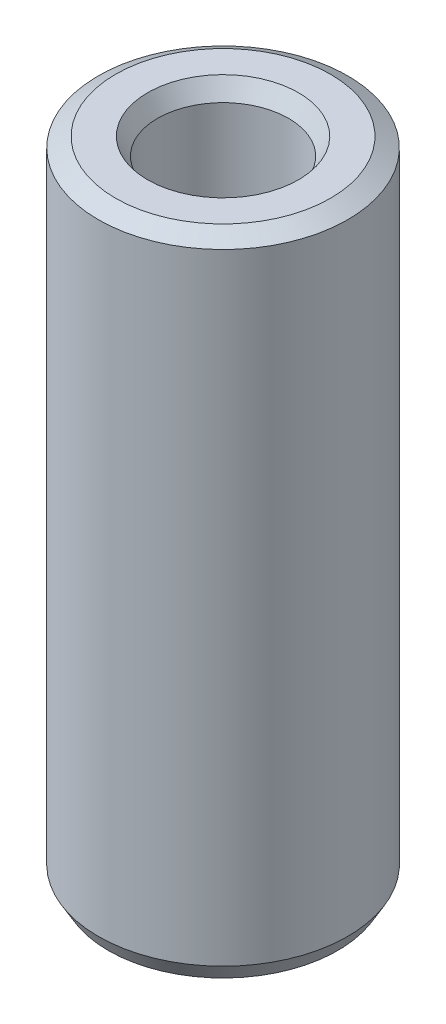
ISO-10303-21;
HEADER;
FILE_DESCRIPTION(('STEP AP214'),'2;1');
FILE_NAME('part.step','',(''),(''),'','','');
FILE_SCHEMA(('AUTOMOTIVE_DESIGN { 1 0 10303 214 1 1 1 1 }'));
ENDSEC;
DATA;
#1=APPLICATION_CONTEXT('core data for automotive mechanical design processes');
#2=APPLICATION_PROTOCOL_DEFINITION('international standard','automotive_design',2000,#1);
#3=PRODUCT_CONTEXT('',#1,'mechanical');
#4=PRODUCT('Part','Part','',(#3));
#5=PRODUCT_RELATED_PRODUCT_CATEGORY('part','',(#4));
#6=PRODUCT_DEFINITION_FORMATION('','',#4);
#7=PRODUCT_DEFINITION_CONTEXT('part definition',#1,'design');
#8=PRODUCT_DEFINITION('design','',#6,#7);
#9=PRODUCT_DEFINITION_SHAPE('','',#8);
#10=(LENGTH_UNIT() NAMED_UNIT(*) SI_UNIT(.MILLI.,.METRE.));
#11=(NAMED_UNIT(*) PLANE_ANGLE_UNIT() SI_UNIT($,.RADIAN.));
#12=(NAMED_UNIT(*) SI_UNIT($,.STERADIAN.) SOLID_ANGLE_UNIT());
#13=UNCERTAINTY_MEASURE_WITH_UNIT(LENGTH_MEASURE(1.E-05),#10,'distance_accuracy_value','');
#14=(GEOMETRIC_REPRESENTATION_CONTEXT(3) GLOBAL_UNCERTAINTY_ASSIGNED_CONTEXT((#13)) GLOBAL_UNIT_ASSIGNED_CONTEXT((#10,
#11,#12)) REPRESENTATION_CONTEXT('',''));
#15=CARTESIAN_POINT('',(0.,0.,0.));
#16=DIRECTION('',(0.,0.,1.));
#17=DIRECTION('',(1.,0.,0.));
#18=AXIS2_PLACEMENT_3D('',#15,#16,#17);
#19=CARTESIAN_POINT('',(0.,142.891635177222,0.));
#20=DIRECTION('',(0.,-1.,0.));
#21=DIRECTION('',(0.,0.,-1.));
#22=AXIS2_PLACEMENT_3D('',#19,#20,#21);
#23=CYLINDRICAL_SURFACE('',#22,27.5);
#24=CARTESIAN_POINT('',(0.,3.8004818086218,0.));
#25=DIRECTION('',(0.,1.,0.));
#26=DIRECTION('',(0.,0.,1.));
#27=AXIS2_PLACEMENT_3D('',#24,#25,#26);
#28=CIRCLE('',#27,27.5);
#29=CARTESIAN_POINT('',(0.,3.8004818086218,27.5));
#30=VERTEX_POINT('',#29);
#31=EDGE_CURVE('E10',#30,#30,#28,.T.);
#32=ORIENTED_EDGE('',*,*,#31,.T.);
#33=EDGE_LOOP('',(#32));
#34=FACE_BOUND('',#33,.T.);
#35=CARTESIAN_POINT('',(0.,140.697425981964,0.));
#36=DIRECTION('',(0.,1.,0.));
#37=DIRECTION('',(0.,0.,1.));
#38=AXIS2_PLACEMENT_3D('',#35,#36,#37);
#39=CIRCLE('',#38,27.5);
#40=CARTESIAN_POINT('',(0.,140.697425981964,27.5));
#41=VERTEX_POINT('',#40);
#42=EDGE_CURVE('E50',#41,#41,#39,.F.);
#43=ORIENTED_EDGE('',*,*,#42,.T.);
#44=EDGE_LOOP('',(#43));
#45=FACE_BOUND('',#44,.T.);
#46=ADVANCED_FACE('F39',(#34,#45),#23,.T.);
#47=CARTESIAN_POINT('',(0.,142.891635177222,0.));
#48=DIRECTION('',(0.,1.,0.));
#49=DIRECTION('',(0.,0.,1.));
#50=AXIS2_PLACEMENT_3D('',#47,#48,#49);
#51=PLANE('',#50);
#52=CARTESIAN_POINT('',(0.,142.891635177222,0.));
#53=DIRECTION('',(0.,1.,0.));
#54=DIRECTION('',(0.,0.,1.));
#55=AXIS2_PLACEMENT_3D('',#52,#53,#54);
#56=CIRCLE('',#55,16.6474647699479);
#57=CARTESIAN_POINT('',(0.,142.891635177222,16.6474647699479));
#58=VERTEX_POINT('',#57);
#59=EDGE_CURVE('E58',#58,#58,#56,.F.);
#60=ORIENTED_EDGE('',*,*,#59,.T.);
#61=EDGE_LOOP('',(#60));
#62=FACE_BOUND('',#61,.T.);
#63=CARTESIAN_POINT('',(0.,142.891635177222,0.));
#64=DIRECTION('',(0.,1.,0.));
#65=DIRECTION('',(0.,0.,1.));
#66=AXIS2_PLACEMENT_3D('',#63,#64,#65);
#67=CIRCLE('',#66,23.6995181913781);
#68=CARTESIAN_POINT('',(0.,142.891635177222,23.6995181913781));
#69=VERTEX_POINT('',#68);
#70=EDGE_CURVE('E61',#69,#69,#67,.T.);
#71=ORIENTED_EDGE('',*,*,#70,.T.);
#72=EDGE_LOOP('',(#71));
#73=FACE_BOUND('',#72,.T.);
#74=ADVANCED_FACE('F88',(#62,#73),#51,.T.);
#75=CARTESIAN_POINT('',(0.,0.,0.));
#76=DIRECTION('',(0.,1.,0.));
#77=DIRECTION('',(0.,0.,1.));
#78=AXIS2_PLACEMENT_3D('',#75,#76,#77);
#79=PLANE('',#78);
#80=CARTESIAN_POINT('',(0.,0.,0.));
#81=DIRECTION('',(0.,1.,0.));
#82=DIRECTION('',(0.,0.,1.));
#83=AXIS2_PLACEMENT_3D('',#80,#81,#82);
#84=CIRCLE('',#83,18.2537373833116);
#85=CARTESIAN_POINT('',(0.,0.,-18.2537373833116));
#86=VERTEX_POINT('',#85);
#87=EDGE_CURVE('E51',#86,#86,#84,.T.);
#88=ORIENTED_EDGE('',*,*,#87,.T.);
#89=EDGE_LOOP('',(#88));
#90=FACE_BOUND('',#89,.T.);
#91=CARTESIAN_POINT('',(0.,0.,0.));
#92=DIRECTION('',(0.,1.,0.));
#93=DIRECTION('',(0.,0.,1.));
#94=AXIS2_PLACEMENT_3D('',#91,#92,#93);
#95=CIRCLE('',#94,25.3057908047419);
#96=CARTESIAN_POINT('',(0.,0.,25.3057908047419));
#97=VERTEX_POINT('',#96);
#98=EDGE_CURVE('E54',#97,#97,#95,.F.);
#99=ORIENTED_EDGE('',*,*,#98,.T.);
#100=EDGE_LOOP('',(#99));
#101=FACE_BOUND('',#100,.T.);
#102=ADVANCED_FACE('F83',(#90,#101),#79,.F.);
#103=CARTESIAN_POINT('',(0.,142.891635177222,0.));
#104=DIRECTION('',(0.,-1.,0.));
#105=DIRECTION('',(0.,0.,-1.));
#106=AXIS2_PLACEMENT_3D('',#103,#104,#105);
#107=CYLINDRICAL_SURFACE('',#106,14.4532555746897);
#108=CARTESIAN_POINT('',(0.,139.0911533686,0.));
#109=DIRECTION('',(0.,1.,0.));
#110=DIRECTION('',(0.,0.,1.));
#111=AXIS2_PLACEMENT_3D('',#108,#109,#110);
#112=CIRCLE('',#111,14.4532555746897);
#113=CARTESIAN_POINT('',(0.,139.0911533686,14.4532555746897));
#114=VERTEX_POINT('',#113);
#115=EDGE_CURVE('E67',#114,#114,#112,.T.);
#116=ORIENTED_EDGE('',*,*,#115,.T.);
#117=EDGE_LOOP('',(#116));
#118=FACE_BOUND('',#117,.T.);
#119=CARTESIAN_POINT('',(0.,2.19420919525812,0.));
#120=DIRECTION('',(0.,1.,0.));
#121=DIRECTION('',(0.,0.,1.));
#122=AXIS2_PLACEMENT_3D('',#119,#120,#121);
#123=CIRCLE('',#122,14.4532555746897);
#124=CARTESIAN_POINT('',(0.,2.19420919525812,-14.4532555746897));
#125=VERTEX_POINT('',#124);
#126=EDGE_CURVE('E69',#125,#125,#123,.F.);
#127=ORIENTED_EDGE('',*,*,#126,.T.);
#128=EDGE_LOOP('',(#127));
#129=FACE_BOUND('',#128,.T.);
#130=ADVANCED_FACE('F71',(#118,#129),#107,.F.);
#131=CARTESIAN_POINT('',(0.,139.0911533686,0.));
#132=DIRECTION('',(0.,1.,0.));
#133=DIRECTION('',(0.,0.,1.));
#134=AXIS2_PLACEMENT_3D('',#131,#132,#133);
#135=CONICAL_SURFACE('',#134,14.4532555746897,0.523598775598301);
#136=ORIENTED_EDGE('',*,*,#59,.F.);
#137=EDGE_LOOP('',(#136));
#138=FACE_BOUND('',#137,.T.);
#139=ORIENTED_EDGE('',*,*,#115,.F.);
#140=EDGE_LOOP('',(#139));
#141=FACE_BOUND('',#140,.T.);
#142=ADVANCED_FACE('F77',(#138,#141),#135,.F.);
#143=CARTESIAN_POINT('',(0.,0.,0.));
#144=DIRECTION('',(0.,-1.,0.));
#145=DIRECTION('',(0.,0.,-1.));
#146=AXIS2_PLACEMENT_3D('',#143,#144,#145);
#147=CONICAL_SURFACE('',#146,18.2537373833116,1.04719755119659);
#148=CARTESIAN_POINT('',(0.,2.19420919525812,-14.4532555746897));
#149=CARTESIAN_POINT('',(0.,2.17135284947418,-14.4928439268629));
#150=CARTESIAN_POINT('',(0.,2.14849650369024,-14.532432279036));
#151=CARTESIAN_POINT('',(0.,2.10278381212236,-14.6116089833823));
#152=CARTESIAN_POINT('',(0.,2.07992746633842,-14.6511973355555));
#153=CARTESIAN_POINT('',(0.,2.03421477477055,-14.7303740399017));
#154=CARTESIAN_POINT('',(0.,2.01135842898661,-14.7699623920749));
#155=CARTESIAN_POINT('',(0.,1.96564573741873,-14.8491390964212));
#156=CARTESIAN_POINT('',(0.,1.94278939163479,-14.8887274485943));
#157=CARTESIAN_POINT('',(0.,1.89707670006691,-14.9679041529406));
#158=CARTESIAN_POINT('',(0.,1.87422035428298,-15.0074925051138));
#159=CARTESIAN_POINT('',(0.,1.8285076627151,-15.08666920946));
#160=CARTESIAN_POINT('',(0.,1.80565131693116,-15.1262575616332));
#161=CARTESIAN_POINT('',(0.,1.75993862536328,-15.2054342659795));
#162=CARTESIAN_POINT('',(0.,1.73708227957934,-15.2450226181526));
#163=CARTESIAN_POINT('',(0.,1.69136958801147,-15.3241993224989));
#164=CARTESIAN_POINT('',(0.,1.66851324222753,-15.3637876746721));
#165=CARTESIAN_POINT('',(0.,1.62280055065965,-15.4429643790183));
#166=CARTESIAN_POINT('',(0.,1.59994420487571,-15.4825527311915));
#167=CARTESIAN_POINT('',(0.,1.55423151330783,-15.5617294355378));
#168=CARTESIAN_POINT('',(0.,1.53137516752389,-15.6013177877109));
#169=CARTESIAN_POINT('',(0.,1.48566247595602,-15.6804944920572));
#170=CARTESIAN_POINT('',(0.,1.46280613017208,-15.7200828442303));
#171=CARTESIAN_POINT('',(0.,1.4170934386042,-15.7992595485766));
#172=CARTESIAN_POINT('',(0.,1.39423709282026,-15.8388479007498));
#173=CARTESIAN_POINT('',(0.,1.34852440125238,-15.9180246050961));
#174=CARTESIAN_POINT('',(0.,1.32566805546845,-15.9576129572692));
#175=CARTESIAN_POINT('',(0.,1.27995536390057,-16.0367896616155));
#176=CARTESIAN_POINT('',(0.,1.25709901811663,-16.0763780137886));
#177=CARTESIAN_POINT('',(0.,1.21138632654875,-16.1555547181349));
#178=CARTESIAN_POINT('',(0.,1.18852998076481,-16.1951430703081));
#179=CARTESIAN_POINT('',(0.,1.14281728919694,-16.2743197746544));
#180=CARTESIAN_POINT('',(0.,1.119960943413,-16.3139081268275));
#181=CARTESIAN_POINT('',(0.,1.07424825184512,-16.3930848311738));
#182=CARTESIAN_POINT('',(0.,1.05139190606118,-16.4326731833469));
#183=CARTESIAN_POINT('',(0.,1.0056792144933,-16.5118498876932));
#184=CARTESIAN_POINT('',(0.,0.982822868709365,-16.5514382398664));
#185=CARTESIAN_POINT('',(0.,0.937110177141488,-16.6306149442127));
#186=CARTESIAN_POINT('',(0.,0.914253831357549,-16.6702032963858));
#187=CARTESIAN_POINT('',(0.,0.868541139789671,-16.7493800007321));
#188=CARTESIAN_POINT('',(0.,0.845684794005733,-16.7889683529052));
#189=CARTESIAN_POINT('',(0.,0.799972102437856,-16.8681450572515));
#190=CARTESIAN_POINT('',(0.,0.777115756653917,-16.9077334094247));
#191=CARTESIAN_POINT('',(0.,0.731403065086039,-16.986910113771));
#192=CARTESIAN_POINT('',(0.,0.708546719302101,-17.0264984659441));
#193=CARTESIAN_POINT('',(0.,0.662834027734223,-17.1056751702904));
#194=CARTESIAN_POINT('',(0.,0.639977681950284,-17.1452635224635));
#195=CARTESIAN_POINT('',(0.,0.594264990382407,-17.2244402268098));
#196=CARTESIAN_POINT('',(0.,0.571408644598468,-17.264028578983));
#197=CARTESIAN_POINT('',(0.,0.525695953030591,-17.3432052833293));
#198=CARTESIAN_POINT('',(0.,0.502839607246652,-17.3827936355024));
#199=CARTESIAN_POINT('',(0.,0.457126915678774,-17.4619703398487));
#200=CARTESIAN_POINT('',(0.,0.434270569894835,-17.5015586920218));
#201=CARTESIAN_POINT('',(0.,0.388557878326958,-17.5807353963681));
#202=CARTESIAN_POINT('',(0.,0.36570153254302,-17.6203237485413));
#203=CARTESIAN_POINT('',(0.,0.319988840975142,-17.6995004528876));
#204=CARTESIAN_POINT('',(0.,0.297132495191203,-17.7390888050607));
#205=CARTESIAN_POINT('',(0.,0.251419803623326,-17.818265509407));
#206=CARTESIAN_POINT('',(0.,0.228563457839387,-17.8578538615801));
#207=CARTESIAN_POINT('',(0.,0.18285076627151,-17.9370305659264));
#208=CARTESIAN_POINT('',(0.,0.159994420487571,-17.9766189180996));
#209=CARTESIAN_POINT('',(0.,0.114281728919693,-18.0557956224458));
#210=CARTESIAN_POINT('',(0.,0.0914253831357549,-18.095383974619));
#211=CARTESIAN_POINT('',(0.,0.045712691567878,-18.1745606789653));
#212=CARTESIAN_POINT('',(0.,0.0228563457839395,-18.2141490311384));
#213=CARTESIAN_POINT('',(0.,0.,-18.2537373833116));
#214=B_SPLINE_CURVE_WITH_KNOTS('',3,(#148,#149,#150,#151,#152,#153,#154,#155,#156,#157,#158,
#159,#160,#161,#162,#163,#164,#165,#166,#167,#168,#169,#170,#171,#172,#173,#174,#175,#176,#177,
#178,#179,#180,#181,#182,#183,#184,#185,#186,#187,#188,#189,#190,#191,#192,#193,#194,#195,#196,
#197,#198,#199,#200,#201,#202,#203,#204,#205,#206,#207,#208,#209,#210,#211,#212,#213),
.UNSPECIFIED.,.F.,.F.,(4,2,2,2,2,2,2,2,2,2,2,2,2,2,2,2,2,2,2,2,2,2,2,2,2,2,2,2,2,2,2,2,4),(0.,
0.13713807470363,0.274276149407262,0.411414224110894,0.548552298814524,0.685690373518156,
0.822828448221786,0.959966522925418,1.09710459762905,1.23424267233268,1.37138074703631,
1.50851882173994,1.64565689644357,1.78279497114721,1.91993304585084,2.05707112055447,
2.1942091952581,2.33134726996173,2.46848534466536,2.60562341936899,2.74276149407262,
2.87989956877625,3.01703764347988,3.15417571818351,3.29131379288715,3.42845186759078,
3.56558994229441,3.70272801699804,3.83986609170167,3.9770041664053,4.11414224110893,
4.25128031581256,4.3884183905162),.UNSPECIFIED.);
#215=EDGE_CURVE('BSEAM73',#125,#86,#214,.T.);
#216=ORIENTED_EDGE('',*,*,#126,.F.);
#217=ORIENTED_EDGE('',*,*,#87,.F.);
#218=ORIENTED_EDGE('',*,*,#215,.T.);
#219=ORIENTED_EDGE('',*,*,#215,.F.);
#220=EDGE_LOOP('',(#216,#218,#217,#219));
#221=FACE_BOUND('',#220,.T.);
#222=ADVANCED_FACE('F73',(#221),#147,.F.);
#223=CARTESIAN_POINT('',(0.,3.8004818086218,0.));
#224=DIRECTION('',(0.,1.,0.));
#225=DIRECTION('',(0.,0.,1.));
#226=AXIS2_PLACEMENT_3D('',#223,#224,#225);
#227=CONICAL_SURFACE('',#226,27.5,0.523598775598306);
#228=ORIENTED_EDGE('',*,*,#98,.F.);
#229=EDGE_LOOP('',(#228));
#230=FACE_BOUND('',#229,.T.);
#231=ORIENTED_EDGE('',*,*,#31,.F.);
#232=EDGE_LOOP('',(#231));
#233=FACE_BOUND('',#232,.T.);
#234=ADVANCED_FACE('F76',(#230,#233),#227,.T.);
#235=CARTESIAN_POINT('',(0.,142.891635177222,0.));
#236=DIRECTION('',(0.,-1.,0.));
#237=DIRECTION('',(0.,0.,-1.));
#238=AXIS2_PLACEMENT_3D('',#235,#236,#237);
#239=CONICAL_SURFACE('',#238,23.6995181913781,1.04719755119659);
#240=ORIENTED_EDGE('',*,*,#42,.F.);
#241=EDGE_LOOP('',(#240));
#242=FACE_BOUND('',#241,.T.);
#243=ORIENTED_EDGE('',*,*,#70,.F.);
#244=EDGE_LOOP('',(#243));
#245=FACE_BOUND('',#244,.T.);
#246=ADVANCED_FACE('F45',(#242,#245),#239,.T.);
#247=CLOSED_SHELL('',(#46,#74,#102,#130,#142,#222,#234,#246));
#248=MANIFOLD_SOLID_BREP('B2',#247);
#249=ADVANCED_BREP_SHAPE_REPRESENTATION('',(#18,#248),#14);
#250=SHAPE_DEFINITION_REPRESENTATION(#9,#249);
ENDSEC;
END-ISO-10303-21;
